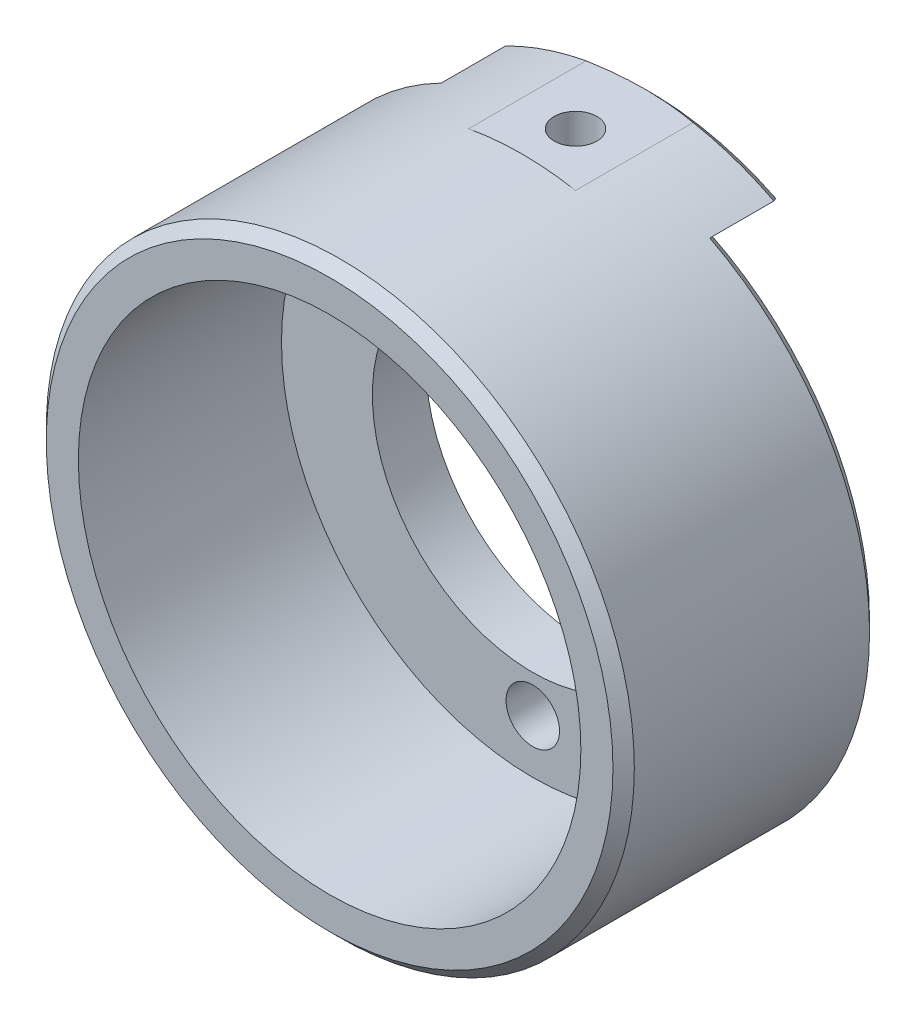
ISO-10303-21;
HEADER;
FILE_DESCRIPTION(('STEP AP214'),'2;1');
FILE_NAME('part.step','',(''),(''),'','','');
FILE_SCHEMA(('AUTOMOTIVE_DESIGN { 1 0 10303 214 1 1 1 1 }'));
ENDSEC;
DATA;
#1=APPLICATION_CONTEXT('core data for automotive mechanical design processes');
#2=APPLICATION_PROTOCOL_DEFINITION('international standard','automotive_design',2000,#1);
#3=PRODUCT_CONTEXT('',#1,'mechanical');
#4=PRODUCT('Part','Part','',(#3));
#5=PRODUCT_RELATED_PRODUCT_CATEGORY('part','',(#4));
#6=PRODUCT_DEFINITION_FORMATION('','',#4);
#7=PRODUCT_DEFINITION_CONTEXT('part definition',#1,'design');
#8=PRODUCT_DEFINITION('design','',#6,#7);
#9=PRODUCT_DEFINITION_SHAPE('','',#8);
#10=(LENGTH_UNIT() NAMED_UNIT(*) SI_UNIT(.MILLI.,.METRE.));
#11=(NAMED_UNIT(*) PLANE_ANGLE_UNIT() SI_UNIT($,.RADIAN.));
#12=(NAMED_UNIT(*) SI_UNIT($,.STERADIAN.) SOLID_ANGLE_UNIT());
#13=UNCERTAINTY_MEASURE_WITH_UNIT(LENGTH_MEASURE(1.E-05),#10,'distance_accuracy_value','');
#14=(GEOMETRIC_REPRESENTATION_CONTEXT(3) GLOBAL_UNCERTAINTY_ASSIGNED_CONTEXT((#13)) GLOBAL_UNIT_ASSIGNED_CONTEXT((#10,
#11,#12)) REPRESENTATION_CONTEXT('',''));
#15=CARTESIAN_POINT('',(0.,0.,0.));
#16=DIRECTION('',(0.,0.,1.));
#17=DIRECTION('',(1.,0.,0.));
#18=AXIS2_PLACEMENT_3D('',#15,#16,#17);
#19=CARTESIAN_POINT('',(-15.,0.,-19.));
#20=DIRECTION('',(0.,0.,1.));
#21=DIRECTION('',(1.,0.,0.));
#22=AXIS2_PLACEMENT_3D('',#19,#20,#21);
#23=PLANE('',#22);
#24=CARTESIAN_POINT('',(0.,18.5,-19.));
#25=DIRECTION('',(0.,0.,1.));
#26=DIRECTION('',(1.,0.,0.));
#27=AXIS2_PLACEMENT_3D('',#24,#25,#26);
#28=CIRCLE('',#27,2.5);
#29=CARTESIAN_POINT('',(2.5,18.5,-19.));
#30=VERTEX_POINT('',#29);
#31=EDGE_CURVE('E895',#30,#30,#28,.F.);
#32=ORIENTED_EDGE('',*,*,#31,.T.);
#33=EDGE_LOOP('',(#32));
#34=FACE_BOUND('',#33,.T.);
#35=CARTESIAN_POINT('',(0.,0.,-19.));
#36=DIRECTION('',(0.,0.,1.));
#37=DIRECTION('',(1.,0.,0.));
#38=AXIS2_PLACEMENT_3D('',#35,#36,#37);
#39=CIRCLE('',#38,23.5);
#40=CARTESIAN_POINT('',(23.5,0.,-19.));
#41=VERTEX_POINT('',#40);
#42=EDGE_CURVE('E306',#41,#41,#39,.T.);
#43=ORIENTED_EDGE('',*,*,#42,.T.);
#44=EDGE_LOOP('',(#43));
#45=FACE_BOUND('',#44,.T.);
#46=CARTESIAN_POINT('',(0.,0.,-19.));
#47=DIRECTION('',(0.,0.,1.));
#48=DIRECTION('',(1.,0.,0.));
#49=AXIS2_PLACEMENT_3D('',#46,#47,#48);
#50=CIRCLE('',#49,15.);
#51=CARTESIAN_POINT('',(15.,0.,-19.));
#52=VERTEX_POINT('',#51);
#53=EDGE_CURVE('E315',#52,#52,#50,.T.);
#54=ORIENTED_EDGE('',*,*,#53,.F.);
#55=EDGE_LOOP('',(#54));
#56=FACE_BOUND('',#55,.T.);
#57=CARTESIAN_POINT('',(0.,-18.5,-19.));
#58=DIRECTION('',(0.,0.,1.));
#59=DIRECTION('',(1.,0.,0.));
#60=AXIS2_PLACEMENT_3D('',#57,#58,#59);
#61=CIRCLE('',#60,2.5);
#62=CARTESIAN_POINT('',(2.5,-18.5,-19.));
#63=VERTEX_POINT('',#62);
#64=EDGE_CURVE('E61',#63,#63,#61,.T.);
#65=ORIENTED_EDGE('',*,*,#64,.F.);
#66=EDGE_LOOP('',(#65));
#67=FACE_BOUND('',#66,.T.);
#68=ADVANCED_FACE('F55',(#34,#45,#56,#67),#23,.T.);
#69=CARTESIAN_POINT('',(0.,0.,8.69565217391304));
#70=DIRECTION('',(0.,0.,1.));
#71=DIRECTION('',(1.,0.,0.));
#72=AXIS2_PLACEMENT_3D('',#69,#70,#71);
#73=CYLINDRICAL_SURFACE('',#72,27.5);
#74=CARTESIAN_POINT('',(0.,0.,-1.00000000000003));
#75=DIRECTION('',(0.,0.,1.));
#76=DIRECTION('',(1.,0.,0.));
#77=AXIS2_PLACEMENT_3D('',#74,#75,#76);
#78=CIRCLE('',#77,27.5);
#79=CARTESIAN_POINT('',(27.5,0.,-1.00000000000003));
#80=VERTEX_POINT('',#79);
#81=EDGE_CURVE('E342',#80,#80,#78,.F.);
#82=ORIENTED_EDGE('',*,*,#81,.T.);
#83=EDGE_LOOP('',(#82));
#84=FACE_BOUND('',#83,.T.);
#85=DIRECTION('',(0.,0.,1.));
#86=VECTOR('',#85,1.);
#87=CARTESIAN_POINT('',(-5.00000000000002,-27.0416345659799,-30.));
#88=LINE('',#87,#86);
#89=CARTESIAN_POINT('',(-5.00000000000002,-27.0416345659799,-29.));
#90=VERTEX_POINT('',#89);
#91=CARTESIAN_POINT('',(-5.,-27.0416345659799,-18.));
#92=VERTEX_POINT('',#91);
#93=EDGE_CURVE('E75',#90,#92,#88,.T.);
#94=ORIENTED_EDGE('',*,*,#93,.T.);
#95=CARTESIAN_POINT('',(0.,0.,-18.));
#96=DIRECTION('',(0.,0.,-1.));
#97=DIRECTION('',(-1.,0.,0.));
#98=AXIS2_PLACEMENT_3D('',#95,#96,#97);
#99=CIRCLE('',#98,27.5);
#100=CARTESIAN_POINT('',(5.,-27.0416345659799,-18.));
#101=VERTEX_POINT('',#100);
#102=EDGE_CURVE('E13',#101,#92,#99,.T.);
#103=ORIENTED_EDGE('',*,*,#102,.F.);
#104=DIRECTION('',(0.,0.,-1.));
#105=VECTOR('',#104,1.);
#106=CARTESIAN_POINT('',(4.99999999999999,-27.0416345659799,-30.));
#107=LINE('',#106,#105);
#108=CARTESIAN_POINT('',(4.99999999999999,-27.0416345659799,-29.));
#109=VERTEX_POINT('',#108);
#110=EDGE_CURVE('E184',#101,#109,#107,.T.);
#111=ORIENTED_EDGE('',*,*,#110,.T.);
#112=CARTESIAN_POINT('',(0.,0.,-29.));
#113=DIRECTION('',(0.,0.,-1.));
#114=DIRECTION('',(-1.,0.,0.));
#115=AXIS2_PLACEMENT_3D('',#112,#113,#114);
#116=CIRCLE('',#115,27.5);
#117=CARTESIAN_POINT('',(12.5555783533499,-24.4664556528503,-29.));
#118=VERTEX_POINT('',#117);
#119=EDGE_CURVE('E335',#109,#118,#116,.F.);
#120=ORIENTED_EDGE('',*,*,#119,.T.);
#121=DIRECTION('',(0.,0.,1.));
#122=VECTOR('',#121,1.);
#123=CARTESIAN_POINT('',(12.5555783533499,-24.4664556528503,-30.));
#124=LINE('',#123,#122);
#125=CARTESIAN_POINT('',(12.5555783533499,-24.4664556528503,-23.));
#126=VERTEX_POINT('',#125);
#127=EDGE_CURVE('E256',#118,#126,#124,.T.);
#128=ORIENTED_EDGE('',*,*,#127,.T.);
#129=CARTESIAN_POINT('',(0.,0.,-23.));
#130=DIRECTION('',(0.,0.,1.));
#131=DIRECTION('',(1.,0.,0.));
#132=AXIS2_PLACEMENT_3D('',#129,#130,#131);
#133=CIRCLE('',#132,27.5);
#134=CARTESIAN_POINT('',(12.5555783533499,24.4664556528503,-23.));
#135=VERTEX_POINT('',#134);
#136=EDGE_CURVE('E331',#126,#135,#133,.T.);
#137=ORIENTED_EDGE('',*,*,#136,.T.);
#138=DIRECTION('',(0.,0.,1.));
#139=VECTOR('',#138,1.);
#140=CARTESIAN_POINT('',(12.5555783533499,24.4664556528503,-30.));
#141=LINE('',#140,#139);
#142=CARTESIAN_POINT('',(12.5555783533499,24.4664556528503,-29.));
#143=VERTEX_POINT('',#142);
#144=EDGE_CURVE('E281',#143,#135,#141,.T.);
#145=ORIENTED_EDGE('',*,*,#144,.F.);
#146=CARTESIAN_POINT('',(0.,0.,-29.));
#147=DIRECTION('',(0.,0.,-1.));
#148=DIRECTION('',(-1.,0.,0.));
#149=AXIS2_PLACEMENT_3D('',#146,#147,#148);
#150=CIRCLE('',#149,27.5);
#151=CARTESIAN_POINT('',(4.99999999999998,27.0416345659799,-29.));
#152=VERTEX_POINT('',#151);
#153=EDGE_CURVE('E327',#143,#152,#150,.F.);
#154=ORIENTED_EDGE('',*,*,#153,.T.);
#155=DIRECTION('',(0.,0.,-1.));
#156=VECTOR('',#155,1.);
#157=CARTESIAN_POINT('',(4.99999999999999,27.0416345659799,-30.));
#158=LINE('',#157,#156);
#159=CARTESIAN_POINT('',(5.,27.0416345659799,-18.));
#160=VERTEX_POINT('',#159);
#161=EDGE_CURVE('E83',#160,#152,#158,.T.);
#162=ORIENTED_EDGE('',*,*,#161,.F.);
#163=CARTESIAN_POINT('',(0.,0.,-18.));
#164=DIRECTION('',(0.,0.,1.));
#165=DIRECTION('',(1.,0.,0.));
#166=AXIS2_PLACEMENT_3D('',#163,#164,#165);
#167=CIRCLE('',#166,27.5);
#168=CARTESIAN_POINT('',(-5.,27.0416345659799,-18.));
#169=VERTEX_POINT('',#168);
#170=EDGE_CURVE('E397',#160,#169,#167,.T.);
#171=ORIENTED_EDGE('',*,*,#170,.T.);
#172=DIRECTION('',(0.,0.,1.));
#173=VECTOR('',#172,1.);
#174=CARTESIAN_POINT('',(-5.00000000000002,27.0416345659799,-30.));
#175=LINE('',#174,#173);
#176=CARTESIAN_POINT('',(-5.00000000000002,27.0416345659799,-29.));
#177=VERTEX_POINT('',#176);
#178=EDGE_CURVE('E214',#177,#169,#175,.T.);
#179=ORIENTED_EDGE('',*,*,#178,.F.);
#180=CARTESIAN_POINT('',(-12.5555783533499,24.4664556528503,-29.));
#181=VERTEX_POINT('',#180);
#182=EDGE_CURVE('E326',#177,#181,#150,.F.);
#183=ORIENTED_EDGE('',*,*,#182,.T.);
#184=DIRECTION('',(0.,0.,1.));
#185=VECTOR('',#184,1.);
#186=CARTESIAN_POINT('',(-12.5555783533499,24.4664556528503,-30.));
#187=LINE('',#186,#185);
#188=CARTESIAN_POINT('',(-12.5555783533499,24.4664556528503,-23.));
#189=VERTEX_POINT('',#188);
#190=EDGE_CURVE('E295',#181,#189,#187,.T.);
#191=ORIENTED_EDGE('',*,*,#190,.T.);
#192=CARTESIAN_POINT('',(0.,0.,-23.));
#193=DIRECTION('',(0.,0.,1.));
#194=DIRECTION('',(1.,0.,0.));
#195=AXIS2_PLACEMENT_3D('',#192,#193,#194);
#196=CIRCLE('',#195,27.5);
#197=CARTESIAN_POINT('',(-12.5555783533499,-24.4664556528503,-23.));
#198=VERTEX_POINT('',#197);
#199=EDGE_CURVE('E338',#189,#198,#196,.T.);
#200=ORIENTED_EDGE('',*,*,#199,.T.);
#201=DIRECTION('',(0.,0.,1.));
#202=VECTOR('',#201,1.);
#203=CARTESIAN_POINT('',(-12.5555783533499,-24.4664556528503,-30.));
#204=LINE('',#203,#202);
#205=CARTESIAN_POINT('',(-12.5555783533499,-24.4664556528503,-29.));
#206=VERTEX_POINT('',#205);
#207=EDGE_CURVE('E253',#206,#198,#204,.T.);
#208=ORIENTED_EDGE('',*,*,#207,.F.);
#209=EDGE_CURVE('E197',#206,#90,#116,.F.);
#210=ORIENTED_EDGE('',*,*,#209,.T.);
#211=EDGE_LOOP('',(#94,#103,#111,#120,#128,#137,#145,#154,#162,#171,#179,#183,#191,#200,#208,#210));
#212=FACE_BOUND('',#211,.T.);
#213=ADVANCED_FACE('F193',(#84,#212),#73,.T.);
#214=CARTESIAN_POINT('',(0.,0.,-30.));
#215=DIRECTION('',(0.,0.,1.));
#216=DIRECTION('',(1.,0.,0.));
#217=AXIS2_PLACEMENT_3D('',#214,#215,#216);
#218=CONICAL_SURFACE('',#217,26.5,0.785398163397443);
#219=ORIENTED_EDGE('',*,*,#119,.F.);
#220=CARTESIAN_POINT('',(15.0500756211209,-27.0416345659799,-25.5523865831069));
#221=CARTESIAN_POINT('',(14.5296760616178,-27.0416345659799,-25.8054233573197));
#222=CARTESIAN_POINT('',(14.0052826862607,-27.0416345659799,-26.050454865097));
#223=CARTESIAN_POINT('',(12.9479675077693,-27.0416345659799,-26.5220870108823));
#224=CARTESIAN_POINT('',(12.4150414991349,-27.0416345659799,-26.7486782031817));
#225=CARTESIAN_POINT('',(11.3378842009209,-27.0416345659799,-27.181858662804));
#226=CARTESIAN_POINT('',(10.7936088371063,-27.0416345659799,-27.388338962018));
#227=CARTESIAN_POINT('',(9.69650665552811,-27.0416345659799,-27.7770275309525));
#228=CARTESIAN_POINT('',(9.14368108399417,-27.0416345659799,-27.9592393013898));
#229=CARTESIAN_POINT('',(8.03777202398614,-27.0416345659799,-28.2939346200528));
#230=CARTESIAN_POINT('',(7.48480764469433,-27.0416345659799,-28.4468096208547));
#231=CARTESIAN_POINT('',(6.37149616932471,-27.0416345659799,-28.7231164458829));
#232=CARTESIAN_POINT('',(5.81114874306676,-27.0416345659799,-28.8465469485618));
#233=CARTESIAN_POINT('',(4.6854764999112,-27.0416345659799,-29.0609931325601));
#234=CARTESIAN_POINT('',(4.12016470877339,-27.0416345659799,-29.1520767844472));
#235=CARTESIAN_POINT('',(2.98508701221859,-27.0416345659799,-29.299920484318));
#236=CARTESIAN_POINT('',(2.41532168552037,-27.0416345659799,-29.3566849192341));
#237=CARTESIAN_POINT('',(1.42167144377623,-27.0416345659799,-29.4243076266971));
#238=CARTESIAN_POINT('',(0.998322077079228,-27.0416345659799,-29.4432585799995));
#239=CARTESIAN_POINT('',(0.151204682347689,-27.0416345659799,-29.4612572113786));
#240=CARTESIAN_POINT('',(-0.272563327959556,-27.0416345659799,-29.4603056988941));
#241=CARTESIAN_POINT('',(-1.11972793216916,-27.0416345659799,-29.4385069304169));
#242=CARTESIAN_POINT('',(-1.5431243489504,-27.0416345659799,-29.4176528542206));
#243=CARTESIAN_POINT('',(-2.38849650677339,-27.0416345659799,-29.3563603631251));
#244=CARTESIAN_POINT('',(-2.81047222634094,-27.0416345659799,-29.3159216535252));
#245=CARTESIAN_POINT('',(-3.6525359710246,-27.0416345659799,-29.2160099498527));
#246=CARTESIAN_POINT('',(-4.07262201845404,-27.0416345659799,-29.1565203109573));
#247=CARTESIAN_POINT('',(-4.90982819176813,-27.0416345659799,-29.0193571539299));
#248=CARTESIAN_POINT('',(-5.32694796940217,-27.0416345659799,-28.9416815358633));
#249=CARTESIAN_POINT('',(-6.57274513713416,-27.0416345659799,-28.6828852841189));
#250=CARTESIAN_POINT('',(-7.39618099965203,-27.0416345659799,-28.4759558931792));
#251=CARTESIAN_POINT('',(-8.80058374562092,-27.0416345659799,-28.0679590549651));
#252=CARTESIAN_POINT('',(-9.38577901938159,-27.0416345659799,-27.8810198956777));
#253=CARTESIAN_POINT('',(-10.5466057034064,-27.0416345659799,-27.4795841958254));
#254=CARTESIAN_POINT('',(-11.1222376962483,-27.0416345659799,-27.265089340907));
#255=CARTESIAN_POINT('',(-12.2620266618528,-27.0416345659799,-26.8127262217107));
#256=CARTESIAN_POINT('',(-12.8262145470319,-27.0416345659799,-26.5749352248));
#257=CARTESIAN_POINT('',(-13.9451133572114,-27.0416345659799,-26.0785321734578));
#258=CARTESIAN_POINT('',(-14.4998278675305,-27.0416345659799,-25.8199282175779));
#259=CARTESIAN_POINT('',(-15.0500756211209,-27.0416345659799,-25.5523865831069));
#260=B_SPLINE_CURVE_WITH_KNOTS('',3,(#220,#221,#222,#223,#224,#225,#226,#227,#228,#229,#230,
#231,#232,#233,#234,#235,#236,#237,#238,#239,#240,#241,#242,#243,#244,#245,#246,#247,#248,#249,
#250,#251,#252,#253,#254,#255,#256,#257,#258,#259),.UNSPECIFIED.,.F.,.F.,(4,2,2,2,2,2,2,2,2,2,2,
2,2,2,2,2,2,2,2,4),(0.,1.73603612227931,3.47295597177922,5.21881694814365,6.96442581199732,
8.68481590547916,10.4052832001205,12.1221135754757,13.8387244466408,15.109607135557,
16.380438137421,17.6517047836363,18.9229905598819,20.1953901045632,21.4679366457185,
24.0120636773891,25.85440780955,27.6966392948192,29.5329550922438,31.3685597818596),.UNSPECIFIED.);
#261=EDGE_CURVE('E67',#109,#90,#260,.T.);
#262=ORIENTED_EDGE('',*,*,#261,.T.);
#263=ORIENTED_EDGE('',*,*,#209,.F.);
#264=CARTESIAN_POINT('',(-11.7215959154198,-23.7666612967748,-30.));
#265=CARTESIAN_POINT('',(-11.8608111857142,-23.8834767787332,-29.8336434259739));
#266=CARTESIAN_POINT('',(-11.9999173582939,-24.0002007168393,-29.6671318044986));
#267=CARTESIAN_POINT('',(-12.2779115042647,-24.2334655021928,-29.3337984711569));
#268=CARTESIAN_POINT('',(-12.4167994776617,-24.3500063494452,-29.1669767592989));
#269=CARTESIAN_POINT('',(-12.5555783533499,-24.4664556528503,-29.));
#270=B_SPLINE_CURVE_WITH_KNOTS('',3,(#264,#265,#266,#267,#268,#269),.UNSPECIFIED.,.F.,.F.,(4,2,
4),(0.,0.739127949388996,1.4782558787888),.UNSPECIFIED.);
#271=CARTESIAN_POINT('',(-11.7215959154198,-23.7666612967748,-30.));
#272=VERTEX_POINT('',#271);
#273=EDGE_CURVE('E353',#272,#206,#270,.T.);
#274=ORIENTED_EDGE('',*,*,#273,.F.);
#275=CARTESIAN_POINT('',(0.,0.,-30.));
#276=DIRECTION('',(0.,0.,-1.));
#277=DIRECTION('',(-1.,0.,0.));
#278=AXIS2_PLACEMENT_3D('',#275,#276,#277);
#279=CIRCLE('',#278,26.5);
#280=CARTESIAN_POINT('',(11.7215959154198,-23.7666612967748,-30.));
#281=VERTEX_POINT('',#280);
#282=EDGE_CURVE('E349',#281,#272,#279,.T.);
#283=ORIENTED_EDGE('',*,*,#282,.F.);
#284=CARTESIAN_POINT('',(12.5555783533499,-24.4664556528503,-29.));
#285=CARTESIAN_POINT('',(12.4167994776617,-24.3500063494452,-29.1669767592989));
#286=CARTESIAN_POINT('',(12.2779115042647,-24.2334655021928,-29.3337984711569));
#287=CARTESIAN_POINT('',(11.9999173582939,-24.0002007168393,-29.6671318044986));
#288=CARTESIAN_POINT('',(11.8608111857142,-23.8834767787332,-29.8336434259739));
#289=CARTESIAN_POINT('',(11.7215959154198,-23.7666612967748,-30.));
#290=B_SPLINE_CURVE_WITH_KNOTS('',3,(#284,#285,#286,#287,#288,#289),.UNSPECIFIED.,.F.,.F.,(4,2,
4),(0.,0.739127929399806,1.4782558787888),.UNSPECIFIED.);
#291=EDGE_CURVE('E362',#118,#281,#290,.T.);
#292=ORIENTED_EDGE('',*,*,#291,.F.);
#293=EDGE_LOOP('',(#219,#262,#263,#274,#283,#292));
#294=FACE_BOUND('',#293,.T.);
#295=ADVANCED_FACE('F373',(#294),#218,.T.);
#296=CARTESIAN_POINT('',(0.,0.,-30.));
#297=DIRECTION('',(0.,0.,1.));
#298=DIRECTION('',(1.,0.,0.));
#299=AXIS2_PLACEMENT_3D('',#296,#297,#298);
#300=CONICAL_SURFACE('',#299,26.5,0.785398163397443);
#301=ORIENTED_EDGE('',*,*,#182,.F.);
#302=CARTESIAN_POINT('',(-15.0500756211209,27.0416345659799,-25.5523865831069));
#303=CARTESIAN_POINT('',(-14.5296760616179,27.0416345659799,-25.8054233573197));
#304=CARTESIAN_POINT('',(-14.0052826862608,27.0416345659799,-26.050454865097));
#305=CARTESIAN_POINT('',(-12.9479675077693,27.0416345659799,-26.5220870108823));
#306=CARTESIAN_POINT('',(-12.4150414991349,27.0416345659799,-26.7486782031817));
#307=CARTESIAN_POINT('',(-11.3378842009209,27.0416345659799,-27.181858662804));
#308=CARTESIAN_POINT('',(-10.7936088371063,27.0416345659799,-27.388338962018));
#309=CARTESIAN_POINT('',(-9.69650665552812,27.0416345659799,-27.7770275309525));
#310=CARTESIAN_POINT('',(-9.14368108399418,27.0416345659799,-27.9592393013898));
#311=CARTESIAN_POINT('',(-8.03777202398615,27.0416345659799,-28.2939346200528));
#312=CARTESIAN_POINT('',(-7.48480764469434,27.0416345659799,-28.4468096208547));
#313=CARTESIAN_POINT('',(-6.37149616932472,27.0416345659799,-28.7231164458829));
#314=CARTESIAN_POINT('',(-5.81114874306676,27.0416345659799,-28.8465469485618));
#315=CARTESIAN_POINT('',(-4.68547649991121,27.0416345659799,-29.0609931325601));
#316=CARTESIAN_POINT('',(-4.12016470877339,27.0416345659799,-29.1520767844472));
#317=CARTESIAN_POINT('',(-2.98508701221859,27.0416345659799,-29.299920484318));
#318=CARTESIAN_POINT('',(-2.41532168552037,27.0416345659799,-29.3566849192341));
#319=CARTESIAN_POINT('',(-1.42167144377623,27.0416345659799,-29.4243076266971));
#320=CARTESIAN_POINT('',(-0.998322077079225,27.0416345659799,-29.4432585799995));
#321=CARTESIAN_POINT('',(-0.151204682347686,27.0416345659799,-29.4612572113786));
#322=CARTESIAN_POINT('',(0.272563327959559,27.0416345659799,-29.4603056988941));
#323=CARTESIAN_POINT('',(1.11972793216916,27.0416345659799,-29.4385069304169));
#324=CARTESIAN_POINT('',(1.5431243489504,27.0416345659799,-29.4176528542206));
#325=CARTESIAN_POINT('',(2.3884965067734,27.0416345659799,-29.3563603631251));
#326=CARTESIAN_POINT('',(2.81047222634094,27.0416345659799,-29.3159216535252));
#327=CARTESIAN_POINT('',(3.6525359710246,27.0416345659799,-29.2160099498527));
#328=CARTESIAN_POINT('',(4.07262201845404,27.0416345659799,-29.1565203109573));
#329=CARTESIAN_POINT('',(4.90982819176814,27.0416345659799,-29.0193571539299));
#330=CARTESIAN_POINT('',(5.32694796940217,27.0416345659799,-28.9416815358633));
#331=CARTESIAN_POINT('',(6.57274513713416,27.0416345659799,-28.6828852841189));
#332=CARTESIAN_POINT('',(7.39618099965203,27.0416345659799,-28.4759558931792));
#333=CARTESIAN_POINT('',(8.80058374562092,27.0416345659799,-28.0679590549651));
#334=CARTESIAN_POINT('',(9.38577901938159,27.0416345659799,-27.8810198956777));
#335=CARTESIAN_POINT('',(10.5466057034064,27.0416345659799,-27.4795841958254));
#336=CARTESIAN_POINT('',(11.1222376962483,27.0416345659799,-27.265089340907));
#337=CARTESIAN_POINT('',(12.2620266618528,27.0416345659799,-26.8127262217107));
#338=CARTESIAN_POINT('',(12.8262145470319,27.0416345659799,-26.5749352248));
#339=CARTESIAN_POINT('',(13.9451133572114,27.0416345659799,-26.0785321734579));
#340=CARTESIAN_POINT('',(14.4998278675305,27.0416345659799,-25.8199282175779));
#341=CARTESIAN_POINT('',(15.0500756211209,27.0416345659799,-25.5523865831069));
#342=B_SPLINE_CURVE_WITH_KNOTS('',3,(#302,#303,#304,#305,#306,#307,#308,#309,#310,#311,#312,
#313,#314,#315,#316,#317,#318,#319,#320,#321,#322,#323,#324,#325,#326,#327,#328,#329,#330,#331,
#332,#333,#334,#335,#336,#337,#338,#339,#340,#341),.UNSPECIFIED.,.F.,.F.,(4,2,2,2,2,2,2,2,2,2,2,
2,2,2,2,2,2,2,2,4),(0.,1.73603612227932,3.47295597177923,5.21881694814366,6.96442581199734,
8.68481590547918,10.4052832001206,12.1221135754757,13.8387244466408,15.1096071355571,
16.3804381374211,17.6517047836363,18.9229905598819,20.1953901045632,21.4679366457185,
24.0120636773891,25.85440780955,27.6966392948192,29.5329550922438,31.3685597818596),.UNSPECIFIED.);
#343=EDGE_CURVE('E421',#177,#152,#342,.T.);
#344=ORIENTED_EDGE('',*,*,#343,.T.);
#345=ORIENTED_EDGE('',*,*,#153,.F.);
#346=CARTESIAN_POINT('',(11.7215959154198,23.7666612967748,-30.));
#347=CARTESIAN_POINT('',(11.8608111857142,23.8834767787332,-29.8336434259739));
#348=CARTESIAN_POINT('',(11.9999173582939,24.0002007168393,-29.6671318044986));
#349=CARTESIAN_POINT('',(12.2779115042647,24.2334655021928,-29.3337984711569));
#350=CARTESIAN_POINT('',(12.4167994776617,24.3500063494452,-29.1669767592989));
#351=CARTESIAN_POINT('',(12.5555783533499,24.4664556528503,-29.));
#352=B_SPLINE_CURVE_WITH_KNOTS('',3,(#346,#347,#348,#349,#350,#351),.UNSPECIFIED.,.F.,.F.,(4,2,
4),(0.,0.739127949388992,1.4782558787888),.UNSPECIFIED.);
#353=CARTESIAN_POINT('',(11.7215959154198,23.7666612967748,-30.));
#354=VERTEX_POINT('',#353);
#355=EDGE_CURVE('E497',#354,#143,#352,.T.);
#356=ORIENTED_EDGE('',*,*,#355,.F.);
#357=CARTESIAN_POINT('',(0.,0.,-30.));
#358=DIRECTION('',(0.,0.,-1.));
#359=DIRECTION('',(-1.,0.,0.));
#360=AXIS2_PLACEMENT_3D('',#357,#358,#359);
#361=CIRCLE('',#360,26.5);
#362=CARTESIAN_POINT('',(-11.7215959154198,23.7666612967748,-30.));
#363=VERTEX_POINT('',#362);
#364=EDGE_CURVE('E502',#363,#354,#361,.T.);
#365=ORIENTED_EDGE('',*,*,#364,.F.);
#366=CARTESIAN_POINT('',(-12.5555783533499,24.4664556528503,-29.));
#367=CARTESIAN_POINT('',(-12.4167994776617,24.3500063494452,-29.1669767592989));
#368=CARTESIAN_POINT('',(-12.2779115042647,24.2334655021928,-29.3337984711569));
#369=CARTESIAN_POINT('',(-11.9999173582939,24.0002007168393,-29.6671318044986));
#370=CARTESIAN_POINT('',(-11.8608111857142,23.8834767787332,-29.8336434259739));
#371=CARTESIAN_POINT('',(-11.7215959154198,23.7666612967748,-30.));
#372=B_SPLINE_CURVE_WITH_KNOTS('',3,(#366,#367,#368,#369,#370,#371),.UNSPECIFIED.,.F.,.F.,(4,2,
4),(0.,0.739127929399806,1.4782558787888),.UNSPECIFIED.);
#373=EDGE_CURVE('E473',#181,#363,#372,.T.);
#374=ORIENTED_EDGE('',*,*,#373,.F.);
#375=EDGE_LOOP('',(#301,#344,#345,#356,#365,#374));
#376=FACE_BOUND('',#375,.T.);
#377=ADVANCED_FACE('F58',(#376),#300,.T.);
#378=CARTESIAN_POINT('',(-15.,0.,-24.));
#379=DIRECTION('',(0.,0.,1.));
#380=DIRECTION('',(1.,0.,0.));
#381=AXIS2_PLACEMENT_3D('',#378,#379,#380);
#382=PLANE('',#381);
#383=DIRECTION('',(0.766044443118979,0.642787609686538,0.));
#384=VECTOR('',#383,1.);
#385=CARTESIAN_POINT('',(-6.85971508146004,8.17509009250272,-24.));
#386=LINE('',#385,#384);
#387=CARTESIAN_POINT('',(2.24975663390288,15.8188444490836,-24.));
#388=VERTEX_POINT('',#387);
#389=CARTESIAN_POINT('',(11.7215959154198,23.7666612967748,-24.));
#390=VERTEX_POINT('',#389);
#391=EDGE_CURVE('E263',#388,#390,#386,.T.);
#392=ORIENTED_EDGE('',*,*,#391,.T.);
#393=CARTESIAN_POINT('',(0.,0.,-24.));
#394=DIRECTION('',(0.,0.,1.));
#395=DIRECTION('',(1.,0.,0.));
#396=AXIS2_PLACEMENT_3D('',#393,#394,#395);
#397=CIRCLE('',#396,26.5);
#398=CARTESIAN_POINT('',(11.7215959154198,-23.7666612967748,-24.));
#399=VERTEX_POINT('',#398);
#400=EDGE_CURVE('E507',#390,#399,#397,.F.);
#401=ORIENTED_EDGE('',*,*,#400,.T.);
#402=DIRECTION('',(0.766044443118979,-0.642787609686538,0.));
#403=VECTOR('',#402,1.);
#404=CARTESIAN_POINT('',(-6.85971508146004,-8.17509009250272,-24.));
#405=LINE('',#404,#403);
#406=CARTESIAN_POINT('',(2.24975663390288,-15.8188444490836,-24.));
#407=VERTEX_POINT('',#406);
#408=EDGE_CURVE('E244',#407,#399,#405,.T.);
#409=ORIENTED_EDGE('',*,*,#408,.F.);
#410=CARTESIAN_POINT('',(0.,-18.5,-24.));
#411=DIRECTION('',(0.,0.,-1.));
#412=DIRECTION('',(-1.,0.,0.));
#413=AXIS2_PLACEMENT_3D('',#410,#411,#412);
#414=CIRCLE('',#413,3.5);
#415=CARTESIAN_POINT('',(0.,-15.,-24.));
#416=VERTEX_POINT('',#415);
#417=EDGE_CURVE('E222',#416,#407,#414,.T.);
#418=ORIENTED_EDGE('',*,*,#417,.F.);
#419=CARTESIAN_POINT('',(0.,0.,-24.));
#420=DIRECTION('',(0.,0.,1.));
#421=DIRECTION('',(1.,0.,0.));
#422=AXIS2_PLACEMENT_3D('',#419,#420,#421);
#423=CIRCLE('',#422,15.);
#424=CARTESIAN_POINT('',(0.,15.,-24.));
#425=VERTEX_POINT('',#424);
#426=EDGE_CURVE('E310',#416,#425,#423,.T.);
#427=ORIENTED_EDGE('',*,*,#426,.T.);
#428=CARTESIAN_POINT('',(0.,18.5,-24.));
#429=DIRECTION('',(0.,0.,-1.));
#430=DIRECTION('',(-1.,0.,0.));
#431=AXIS2_PLACEMENT_3D('',#428,#429,#430);
#432=CIRCLE('',#431,3.5);
#433=EDGE_CURVE('E289',#425,#388,#432,.F.);
#434=ORIENTED_EDGE('',*,*,#433,.T.);
#435=EDGE_LOOP('',(#392,#401,#409,#418,#427,#434));
#436=FACE_BOUND('',#435,.T.);
#437=ADVANCED_FACE('F519',(#436),#382,.F.);
#438=DIRECTION('',(-0.766044443118979,-0.642787609686538,0.));
#439=VECTOR('',#438,1.);
#440=CARTESIAN_POINT('',(6.85971508146004,-8.17509009250272,-24.));
#441=LINE('',#440,#439);
#442=CARTESIAN_POINT('',(-2.24975663390288,-15.8188444490836,-24.));
#443=VERTEX_POINT('',#442);
#444=CARTESIAN_POINT('',(-11.7215959154198,-23.7666612967748,-24.));
#445=VERTEX_POINT('',#444);
#446=EDGE_CURVE('E228',#443,#445,#441,.T.);
#447=ORIENTED_EDGE('',*,*,#446,.T.);
#448=CARTESIAN_POINT('',(0.,0.,-24.));
#449=DIRECTION('',(0.,0.,1.));
#450=DIRECTION('',(1.,0.,0.));
#451=AXIS2_PLACEMENT_3D('',#448,#449,#450);
#452=CIRCLE('',#451,26.5);
#453=CARTESIAN_POINT('',(-11.7215959154198,23.7666612967748,-24.));
#454=VERTEX_POINT('',#453);
#455=EDGE_CURVE('E346',#445,#454,#452,.F.);
#456=ORIENTED_EDGE('',*,*,#455,.T.);
#457=DIRECTION('',(-0.766044443118979,0.642787609686538,0.));
#458=VECTOR('',#457,1.);
#459=CARTESIAN_POINT('',(6.85971508146004,8.17509009250272,-24.));
#460=LINE('',#459,#458);
#461=CARTESIAN_POINT('',(-2.24975663390288,15.8188444490836,-24.));
#462=VERTEX_POINT('',#461);
#463=EDGE_CURVE('E269',#462,#454,#460,.T.);
#464=ORIENTED_EDGE('',*,*,#463,.F.);
#465=EDGE_CURVE('E285',#462,#425,#432,.F.);
#466=ORIENTED_EDGE('',*,*,#465,.T.);
#467=EDGE_CURVE('E311',#425,#416,#423,.T.);
#468=ORIENTED_EDGE('',*,*,#467,.T.);
#469=EDGE_CURVE('E241',#443,#416,#414,.T.);
#470=ORIENTED_EDGE('',*,*,#469,.F.);
#471=EDGE_LOOP('',(#447,#456,#464,#466,#468,#470));
#472=FACE_BOUND('',#471,.T.);
#473=ADVANCED_FACE('F523',(#472),#382,.F.);
#474=CARTESIAN_POINT('',(0.,0.,8.69565217391304));
#475=DIRECTION('',(0.,0.,1.));
#476=DIRECTION('',(1.,0.,0.));
#477=AXIS2_PLACEMENT_3D('',#474,#475,#476);
#478=CYLINDRICAL_SURFACE('',#477,15.);
#479=ORIENTED_EDGE('',*,*,#53,.T.);
#480=EDGE_LOOP('',(#479));
#481=FACE_BOUND('',#480,.T.);
#482=ORIENTED_EDGE('',*,*,#467,.F.);
#483=ORIENTED_EDGE('',*,*,#426,.F.);
#484=EDGE_LOOP('',(#482,#483));
#485=FACE_BOUND('',#484,.T.);
#486=ADVANCED_FACE('F518',(#481,#485),#478,.F.);
#487=CARTESIAN_POINT('',(-23.5,0.,0.));
#488=DIRECTION('',(0.,0.,1.));
#489=DIRECTION('',(1.,0.,0.));
#490=AXIS2_PLACEMENT_3D('',#487,#488,#489);
#491=PLANE('',#490);
#492=CARTESIAN_POINT('',(0.,0.,0.));
#493=DIRECTION('',(0.,0.,1.));
#494=DIRECTION('',(1.,0.,0.));
#495=AXIS2_PLACEMENT_3D('',#492,#493,#494);
#496=CIRCLE('',#495,26.5);
#497=CARTESIAN_POINT('',(26.5,0.,0.));
#498=VERTEX_POINT('',#497);
#499=EDGE_CURVE('E322',#498,#498,#496,.T.);
#500=ORIENTED_EDGE('',*,*,#499,.T.);
#501=EDGE_LOOP('',(#500));
#502=FACE_BOUND('',#501,.T.);
#503=CARTESIAN_POINT('',(0.,0.,0.));
#504=DIRECTION('',(0.,0.,1.));
#505=DIRECTION('',(1.,0.,0.));
#506=AXIS2_PLACEMENT_3D('',#503,#504,#505);
#507=CIRCLE('',#506,23.5);
#508=CARTESIAN_POINT('',(23.5,0.,0.));
#509=VERTEX_POINT('',#508);
#510=EDGE_CURVE('E305',#509,#509,#507,.T.);
#511=ORIENTED_EDGE('',*,*,#510,.F.);
#512=EDGE_LOOP('',(#511));
#513=FACE_BOUND('',#512,.T.);
#514=ADVANCED_FACE('F527',(#502,#513),#491,.T.);
#515=CARTESIAN_POINT('',(0.,0.,8.69565217391304));
#516=DIRECTION('',(0.,0.,1.));
#517=DIRECTION('',(1.,0.,0.));
#518=AXIS2_PLACEMENT_3D('',#515,#516,#517);
#519=CYLINDRICAL_SURFACE('',#518,23.5);
#520=ORIENTED_EDGE('',*,*,#42,.F.);
#521=EDGE_LOOP('',(#520));
#522=FACE_BOUND('',#521,.T.);
#523=ORIENTED_EDGE('',*,*,#510,.T.);
#524=EDGE_LOOP('',(#523));
#525=FACE_BOUND('',#524,.T.);
#526=ADVANCED_FACE('F517',(#522,#525),#519,.F.);
#527=CARTESIAN_POINT('',(-6.85971508146004,8.17509009250272,-30.));
#528=DIRECTION('',(0.642787609686538,-0.766044443118979,0.));
#529=DIRECTION('',(0.766044443118979,0.642787609686538,0.));
#530=AXIS2_PLACEMENT_3D('',#527,#528,#529);
#531=PLANE('',#530);
#532=DIRECTION('',(0.766044443118979,0.642787609686538,0.));
#533=VECTOR('',#532,1.);
#534=CARTESIAN_POINT('',(-6.85971508146004,8.17509009250272,-30.));
#535=LINE('',#534,#533);
#536=CARTESIAN_POINT('',(2.24975663390288,15.8188444490836,-30.));
#537=VERTEX_POINT('',#536);
#538=EDGE_CURVE('E264',#537,#354,#535,.T.);
#539=ORIENTED_EDGE('',*,*,#538,.T.);
#540=ORIENTED_EDGE('',*,*,#355,.T.);
#541=ORIENTED_EDGE('',*,*,#144,.T.);
#542=CARTESIAN_POINT('',(12.5555783533499,24.4664556528503,-23.));
#543=CARTESIAN_POINT('',(12.4167994776617,24.3500063494452,-23.1669767592989));
#544=CARTESIAN_POINT('',(12.2779115042647,24.2334655021928,-23.3337984711569));
#545=CARTESIAN_POINT('',(11.9999173582939,24.0002007168393,-23.6671318044986));
#546=CARTESIAN_POINT('',(11.8608111857142,23.8834767787332,-23.8336434259739));
#547=CARTESIAN_POINT('',(11.7215959154198,23.7666612967748,-24.));
#548=B_SPLINE_CURVE_WITH_KNOTS('',3,(#542,#543,#544,#545,#546,#547),.UNSPECIFIED.,.F.,.F.,(4,2,
4),(0.,0.739127929399808,1.47825587878881),.UNSPECIFIED.);
#549=EDGE_CURVE('E436',#135,#390,#548,.T.);
#550=ORIENTED_EDGE('',*,*,#549,.T.);
#551=ORIENTED_EDGE('',*,*,#391,.F.);
#552=DIRECTION('',(0.,0.,1.));
#553=VECTOR('',#552,1.);
#554=CARTESIAN_POINT('',(2.24975663390288,15.8188444490836,-30.));
#555=LINE('',#554,#553);
#556=EDGE_CURVE('E301',#537,#388,#555,.T.);
#557=ORIENTED_EDGE('',*,*,#556,.F.);
#558=EDGE_LOOP('',(#539,#540,#541,#550,#551,#557));
#559=FACE_BOUND('',#558,.T.);
#560=ADVANCED_FACE('F513',(#559),#531,.T.);
#561=CARTESIAN_POINT('',(0.,18.5,-30.));
#562=DIRECTION('',(0.,0.,1.));
#563=DIRECTION('',(1.,0.,0.));
#564=AXIS2_PLACEMENT_3D('',#561,#562,#563);
#565=CYLINDRICAL_SURFACE('',#564,3.5);
#566=ORIENTED_EDGE('',*,*,#465,.F.);
#567=DIRECTION('',(0.,0.,1.));
#568=VECTOR('',#567,1.);
#569=CARTESIAN_POINT('',(-2.24975663390288,15.8188444490836,-30.));
#570=LINE('',#569,#568);
#571=CARTESIAN_POINT('',(-2.24975663390288,15.8188444490836,-30.));
#572=VERTEX_POINT('',#571);
#573=EDGE_CURVE('E298',#572,#462,#570,.T.);
#574=ORIENTED_EDGE('',*,*,#573,.F.);
#575=CARTESIAN_POINT('',(0.,18.5,-30.));
#576=DIRECTION('',(0.,0.,-1.));
#577=DIRECTION('',(-1.,0.,0.));
#578=AXIS2_PLACEMENT_3D('',#575,#576,#577);
#579=CIRCLE('',#578,3.5);
#580=EDGE_CURVE('E268',#572,#537,#579,.F.);
#581=ORIENTED_EDGE('',*,*,#580,.T.);
#582=ORIENTED_EDGE('',*,*,#556,.T.);
#583=ORIENTED_EDGE('',*,*,#433,.F.);
#584=EDGE_LOOP('',(#566,#574,#581,#582,#583));
#585=FACE_BOUND('',#584,.T.);
#586=ADVANCED_FACE('F469',(#585),#565,.T.);
#587=CARTESIAN_POINT('',(6.85971508146004,8.17509009250272,-30.));
#588=DIRECTION('',(0.642787609686538,0.766044443118979,0.));
#589=DIRECTION('',(-0.766044443118979,0.642787609686538,0.));
#590=AXIS2_PLACEMENT_3D('',#587,#588,#589);
#591=PLANE('',#590);
#592=ORIENTED_EDGE('',*,*,#190,.F.);
#593=ORIENTED_EDGE('',*,*,#373,.T.);
#594=DIRECTION('',(-0.766044443118979,0.642787609686538,0.));
#595=VECTOR('',#594,1.);
#596=CARTESIAN_POINT('',(6.85971508146004,8.17509009250272,-30.));
#597=LINE('',#596,#595);
#598=EDGE_CURVE('E273',#572,#363,#597,.T.);
#599=ORIENTED_EDGE('',*,*,#598,.F.);
#600=ORIENTED_EDGE('',*,*,#573,.T.);
#601=ORIENTED_EDGE('',*,*,#463,.T.);
#602=CARTESIAN_POINT('',(-11.7215959154198,23.7666612967748,-24.));
#603=CARTESIAN_POINT('',(-11.8608111857142,23.8834767787332,-23.8336434259739));
#604=CARTESIAN_POINT('',(-11.9999173582939,24.0002007168393,-23.6671318044986));
#605=CARTESIAN_POINT('',(-12.2779115042647,24.2334655021928,-23.3337984711569));
#606=CARTESIAN_POINT('',(-12.4167994776617,24.3500063494452,-23.1669767592989));
#607=CARTESIAN_POINT('',(-12.5555783533499,24.4664556528503,-23.));
#608=B_SPLINE_CURVE_WITH_KNOTS('',3,(#602,#603,#604,#605,#606,#607),.UNSPECIFIED.,.F.,.F.,(4,2,
4),(0.,0.739127949389002,1.47825587878881),.UNSPECIFIED.);
#609=EDGE_CURVE('E480',#454,#189,#608,.T.);
#610=ORIENTED_EDGE('',*,*,#609,.T.);
#611=EDGE_LOOP('',(#592,#593,#599,#600,#601,#610));
#612=FACE_BOUND('',#611,.T.);
#613=ADVANCED_FACE('F464',(#612),#591,.F.);
#614=CARTESIAN_POINT('',(0.,18.5,-30.));
#615=DIRECTION('',(0.,0.,1.));
#616=DIRECTION('',(1.,0.,0.));
#617=AXIS2_PLACEMENT_3D('',#614,#615,#616);
#618=CYLINDRICAL_SURFACE('',#617,2.5);
#619=CARTESIAN_POINT('',(0.,18.5,-30.));
#620=DIRECTION('',(0.,0.,-1.));
#621=DIRECTION('',(-1.,0.,0.));
#622=AXIS2_PLACEMENT_3D('',#619,#620,#621);
#623=CIRCLE('',#622,2.5);
#624=CARTESIAN_POINT('',(-2.5,18.5,-30.));
#625=VERTEX_POINT('',#624);
#626=EDGE_CURVE('E277',#625,#625,#623,.F.);
#627=ORIENTED_EDGE('',*,*,#626,.F.);
#628=EDGE_LOOP('',(#627));
#629=FACE_BOUND('',#628,.T.);
#630=ORIENTED_EDGE('',*,*,#31,.F.);
#631=EDGE_LOOP('',(#630));
#632=FACE_BOUND('',#631,.T.);
#633=ADVANCED_FACE('F460',(#629,#632),#618,.F.);
#634=CARTESIAN_POINT('',(0.,0.,-30.));
#635=DIRECTION('',(0.,0.,-1.));
#636=DIRECTION('',(-1.,0.,0.));
#637=AXIS2_PLACEMENT_3D('',#634,#635,#636);
#638=PLANE('',#637);
#639=ORIENTED_EDGE('',*,*,#598,.T.);
#640=ORIENTED_EDGE('',*,*,#364,.T.);
#641=ORIENTED_EDGE('',*,*,#538,.F.);
#642=ORIENTED_EDGE('',*,*,#580,.F.);
#643=EDGE_LOOP('',(#639,#640,#641,#642));
#644=FACE_BOUND('',#643,.T.);
#645=ORIENTED_EDGE('',*,*,#626,.T.);
#646=EDGE_LOOP('',(#645));
#647=FACE_BOUND('',#646,.T.);
#648=ADVANCED_FACE('F453',(#644,#647),#638,.T.);
#649=CARTESIAN_POINT('',(0.,-18.5,-30.));
#650=DIRECTION('',(0.,0.,1.));
#651=DIRECTION('',(1.,0.,0.));
#652=AXIS2_PLACEMENT_3D('',#649,#650,#651);
#653=CYLINDRICAL_SURFACE('',#652,3.5);
#654=ORIENTED_EDGE('',*,*,#469,.T.);
#655=ORIENTED_EDGE('',*,*,#417,.T.);
#656=DIRECTION('',(0.,0.,1.));
#657=VECTOR('',#656,1.);
#658=CARTESIAN_POINT('',(2.24975663390288,-15.8188444490836,-30.));
#659=LINE('',#658,#657);
#660=CARTESIAN_POINT('',(2.24975663390288,-15.8188444490836,-30.));
#661=VERTEX_POINT('',#660);
#662=EDGE_CURVE('E259',#661,#407,#659,.T.);
#663=ORIENTED_EDGE('',*,*,#662,.F.);
#664=CARTESIAN_POINT('',(0.,-18.5,-30.));
#665=DIRECTION('',(0.,0.,-1.));
#666=DIRECTION('',(-1.,0.,0.));
#667=AXIS2_PLACEMENT_3D('',#664,#665,#666);
#668=CIRCLE('',#667,3.5);
#669=CARTESIAN_POINT('',(-2.24975663390288,-15.8188444490836,-30.));
#670=VERTEX_POINT('',#669);
#671=EDGE_CURVE('E227',#670,#661,#668,.T.);
#672=ORIENTED_EDGE('',*,*,#671,.F.);
#673=DIRECTION('',(0.,0.,1.));
#674=VECTOR('',#673,1.);
#675=CARTESIAN_POINT('',(-2.24975663390288,-15.8188444490836,-30.));
#676=LINE('',#675,#674);
#677=EDGE_CURVE('E240',#670,#443,#676,.T.);
#678=ORIENTED_EDGE('',*,*,#677,.T.);
#679=EDGE_LOOP('',(#654,#655,#663,#672,#678));
#680=FACE_BOUND('',#679,.T.);
#681=ADVANCED_FACE('F448',(#680),#653,.T.);
#682=CARTESIAN_POINT('',(-6.85971508146004,-8.17509009250272,-30.));
#683=DIRECTION('',(-0.642787609686538,-0.766044443118979,0.));
#684=DIRECTION('',(0.766044443118979,-0.642787609686538,0.));
#685=AXIS2_PLACEMENT_3D('',#682,#683,#684);
#686=PLANE('',#685);
#687=ORIENTED_EDGE('',*,*,#127,.F.);
#688=ORIENTED_EDGE('',*,*,#291,.T.);
#689=DIRECTION('',(0.766044443118979,-0.642787609686538,0.));
#690=VECTOR('',#689,1.);
#691=CARTESIAN_POINT('',(-6.85971508146004,-8.17509009250272,-30.));
#692=LINE('',#691,#690);
#693=EDGE_CURVE('E232',#661,#281,#692,.T.);
#694=ORIENTED_EDGE('',*,*,#693,.F.);
#695=ORIENTED_EDGE('',*,*,#662,.T.);
#696=ORIENTED_EDGE('',*,*,#408,.T.);
#697=CARTESIAN_POINT('',(11.7215959154198,-23.7666612967748,-24.));
#698=CARTESIAN_POINT('',(11.8608111857142,-23.8834767787332,-23.8336434259739));
#699=CARTESIAN_POINT('',(11.9999173582939,-24.0002007168393,-23.6671318044986));
#700=CARTESIAN_POINT('',(12.2779115042647,-24.2334655021928,-23.3337984711569));
#701=CARTESIAN_POINT('',(12.4167994776617,-24.3500063494452,-23.1669767592989));
#702=CARTESIAN_POINT('',(12.5555783533499,-24.4664556528503,-23.));
#703=B_SPLINE_CURVE_WITH_KNOTS('',3,(#697,#698,#699,#700,#701,#702),.UNSPECIFIED.,.F.,.F.,(4,2,
4),(0.,0.739127949388999,1.47825587878881),.UNSPECIFIED.);
#704=EDGE_CURVE('E428',#399,#126,#703,.T.);
#705=ORIENTED_EDGE('',*,*,#704,.T.);
#706=EDGE_LOOP('',(#687,#688,#694,#695,#696,#705));
#707=FACE_BOUND('',#706,.T.);
#708=ADVANCED_FACE('F443',(#707),#686,.F.);
#709=CARTESIAN_POINT('',(0.,-18.5,-30.));
#710=DIRECTION('',(0.,0.,1.));
#711=DIRECTION('',(1.,0.,0.));
#712=AXIS2_PLACEMENT_3D('',#709,#710,#711);
#713=CYLINDRICAL_SURFACE('',#712,2.5);
#714=CARTESIAN_POINT('',(0.,-18.5,-30.));
#715=DIRECTION('',(0.,0.,-1.));
#716=DIRECTION('',(-1.,0.,0.));
#717=AXIS2_PLACEMENT_3D('',#714,#715,#716);
#718=CIRCLE('',#717,2.5);
#719=CARTESIAN_POINT('',(-2.5,-18.5,-30.));
#720=VERTEX_POINT('',#719);
#721=EDGE_CURVE('E223',#720,#720,#718,.T.);
#722=ORIENTED_EDGE('',*,*,#721,.T.);
#723=EDGE_LOOP('',(#722));
#724=FACE_BOUND('',#723,.T.);
#725=ORIENTED_EDGE('',*,*,#64,.T.);
#726=EDGE_LOOP('',(#725));
#727=FACE_BOUND('',#726,.T.);
#728=ADVANCED_FACE('F447',(#724,#727),#713,.F.);
#729=CARTESIAN_POINT('',(6.85971508146004,-8.17509009250272,-30.));
#730=DIRECTION('',(-0.642787609686538,0.766044443118979,0.));
#731=DIRECTION('',(-0.766044443118979,-0.642787609686538,0.));
#732=AXIS2_PLACEMENT_3D('',#729,#730,#731);
#733=PLANE('',#732);
#734=DIRECTION('',(-0.766044443118979,-0.642787609686538,0.));
#735=VECTOR('',#734,1.);
#736=CARTESIAN_POINT('',(6.85971508146004,-8.17509009250272,-30.));
#737=LINE('',#736,#735);
#738=EDGE_CURVE('E236',#670,#272,#737,.T.);
#739=ORIENTED_EDGE('',*,*,#738,.T.);
#740=ORIENTED_EDGE('',*,*,#273,.T.);
#741=ORIENTED_EDGE('',*,*,#207,.T.);
#742=CARTESIAN_POINT('',(-12.5555783533499,-24.4664556528503,-23.));
#743=CARTESIAN_POINT('',(-12.4167994776617,-24.3500063494452,-23.1669767592989));
#744=CARTESIAN_POINT('',(-12.2779115042647,-24.2334655021928,-23.3337984711569));
#745=CARTESIAN_POINT('',(-11.9999173582939,-24.0002007168393,-23.6671318044986));
#746=CARTESIAN_POINT('',(-11.8608111857142,-23.8834767787332,-23.8336434259739));
#747=CARTESIAN_POINT('',(-11.7215959154198,-23.7666612967748,-24.));
#748=B_SPLINE_CURVE_WITH_KNOTS('',3,(#742,#743,#744,#745,#746,#747),.UNSPECIFIED.,.F.,.F.,(4,2,
4),(0.,0.739127929399808,1.47825587878881),.UNSPECIFIED.);
#749=EDGE_CURVE('E487',#198,#445,#748,.T.);
#750=ORIENTED_EDGE('',*,*,#749,.T.);
#751=ORIENTED_EDGE('',*,*,#446,.F.);
#752=ORIENTED_EDGE('',*,*,#677,.F.);
#753=EDGE_LOOP('',(#739,#740,#741,#750,#751,#752));
#754=FACE_BOUND('',#753,.T.);
#755=ADVANCED_FACE('F369',(#754),#733,.T.);
#756=CARTESIAN_POINT('',(0.,0.,-30.));
#757=DIRECTION('',(0.,0.,-1.));
#758=DIRECTION('',(-1.,0.,0.));
#759=AXIS2_PLACEMENT_3D('',#756,#757,#758);
#760=PLANE('',#759);
#761=ORIENTED_EDGE('',*,*,#721,.F.);
#762=EDGE_LOOP('',(#761));
#763=FACE_BOUND('',#762,.T.);
#764=ORIENTED_EDGE('',*,*,#693,.T.);
#765=ORIENTED_EDGE('',*,*,#282,.T.);
#766=ORIENTED_EDGE('',*,*,#738,.F.);
#767=ORIENTED_EDGE('',*,*,#671,.T.);
#768=EDGE_LOOP('',(#764,#765,#766,#767));
#769=FACE_BOUND('',#768,.T.);
#770=ADVANCED_FACE('F545',(#763,#769),#760,.T.);
#771=CARTESIAN_POINT('',(0.,0.,0.));
#772=DIRECTION('',(0.,0.,-1.));
#773=DIRECTION('',(-1.,0.,0.));
#774=AXIS2_PLACEMENT_3D('',#771,#772,#773);
#775=CONICAL_SURFACE('',#774,26.5,0.785398163397441);
#776=ORIENTED_EDGE('',*,*,#81,.F.);
#777=EDGE_LOOP('',(#776));
#778=FACE_BOUND('',#777,.T.);
#779=ORIENTED_EDGE('',*,*,#499,.F.);
#780=EDGE_LOOP('',(#779));
#781=FACE_BOUND('',#780,.T.);
#782=ADVANCED_FACE('F541',(#778,#781),#775,.T.);
#783=CARTESIAN_POINT('',(0.,0.,-23.));
#784=DIRECTION('',(0.,0.,1.));
#785=DIRECTION('',(1.,0.,0.));
#786=AXIS2_PLACEMENT_3D('',#783,#784,#785);
#787=CONICAL_SURFACE('',#786,27.5,0.785398163397448);
#788=ORIENTED_EDGE('',*,*,#609,.F.);
#789=ORIENTED_EDGE('',*,*,#455,.F.);
#790=ORIENTED_EDGE('',*,*,#749,.F.);
#791=ORIENTED_EDGE('',*,*,#199,.F.);
#792=EDGE_LOOP('',(#788,#789,#790,#791));
#793=FACE_BOUND('',#792,.T.);
#794=ADVANCED_FACE('F382',(#793),#787,.T.);
#795=CARTESIAN_POINT('',(0.,0.,-23.));
#796=DIRECTION('',(0.,0.,1.));
#797=DIRECTION('',(1.,0.,0.));
#798=AXIS2_PLACEMENT_3D('',#795,#796,#797);
#799=CONICAL_SURFACE('',#798,27.5,0.785398163397448);
#800=ORIENTED_EDGE('',*,*,#704,.F.);
#801=ORIENTED_EDGE('',*,*,#400,.F.);
#802=ORIENTED_EDGE('',*,*,#549,.F.);
#803=ORIENTED_EDGE('',*,*,#136,.F.);
#804=EDGE_LOOP('',(#800,#801,#802,#803));
#805=FACE_BOUND('',#804,.T.);
#806=ADVANCED_FACE('F385',(#805),#799,.T.);
#807=CARTESIAN_POINT('',(-5.,27.0416345659799,-18.));
#808=DIRECTION('',(0.,0.,1.));
#809=DIRECTION('',(1.,0.,0.));
#810=AXIS2_PLACEMENT_3D('',#807,#808,#809);
#811=PLANE('',#810);
#812=DIRECTION('',(1.,0.,0.));
#813=VECTOR('',#812,1.);
#814=CARTESIAN_POINT('',(-5.,27.0416345659799,-18.));
#815=LINE('',#814,#813);
#816=EDGE_CURVE('E217',#169,#160,#815,.T.);
#817=ORIENTED_EDGE('',*,*,#816,.F.);
#818=ORIENTED_EDGE('',*,*,#170,.F.);
#819=EDGE_LOOP('',(#817,#818));
#820=FACE_BOUND('',#819,.T.);
#821=ADVANCED_FACE('F419',(#820),#811,.F.);
#822=CARTESIAN_POINT('',(0.,27.0416345659799,0.));
#823=DIRECTION('',(0.,1.,0.));
#824=DIRECTION('',(0.,0.,1.));
#825=AXIS2_PLACEMENT_3D('',#822,#823,#824);
#826=PLANE('',#825);
#827=CARTESIAN_POINT('',(0.,27.0416345659799,-23.));
#828=DIRECTION('',(0.,1.,0.));
#829=DIRECTION('',(0.,0.,1.));
#830=AXIS2_PLACEMENT_3D('',#827,#828,#829);
#831=CIRCLE('',#830,2.00000000000001);
#832=CARTESIAN_POINT('',(0.,27.0416345659799,-21.));
#833=VERTEX_POINT('',#832);
#834=EDGE_CURVE('E210',#833,#833,#831,.T.);
#835=ORIENTED_EDGE('',*,*,#834,.F.);
#836=EDGE_LOOP('',(#835));
#837=FACE_BOUND('',#836,.T.);
#838=ORIENTED_EDGE('',*,*,#178,.T.);
#839=ORIENTED_EDGE('',*,*,#816,.T.);
#840=ORIENTED_EDGE('',*,*,#161,.T.);
#841=ORIENTED_EDGE('',*,*,#343,.F.);
#842=EDGE_LOOP('',(#838,#839,#840,#841));
#843=FACE_BOUND('',#842,.T.);
#844=ADVANCED_FACE('F414',(#837,#843),#826,.T.);
#845=CARTESIAN_POINT('',(0.,11.3847803164875,-23.));
#846=DIRECTION('',(0.,1.,0.));
#847=DIRECTION('',(0.,0.,1.));
#848=AXIS2_PLACEMENT_3D('',#845,#846,#847);
#849=CYLINDRICAL_SURFACE('',#848,2.00000000000001);
#850=ORIENTED_EDGE('',*,*,#834,.T.);
#851=EDGE_LOOP('',(#850));
#852=FACE_BOUND('',#851,.T.);
#853=CARTESIAN_POINT('',(0.,22.0416345659799,-23.));
#854=DIRECTION('',(0.,1.,0.));
#855=DIRECTION('',(0.,0.,1.));
#856=AXIS2_PLACEMENT_3D('',#853,#854,#855);
#857=CIRCLE('',#856,2.00000000000001);
#858=CARTESIAN_POINT('',(0.,22.0416345659799,-21.));
#859=VERTEX_POINT('',#858);
#860=EDGE_CURVE('E183',#859,#859,#857,.F.);
#861=ORIENTED_EDGE('',*,*,#860,.T.);
#862=EDGE_LOOP('',(#861));
#863=FACE_BOUND('',#862,.T.);
#864=ADVANCED_FACE('F410',(#852,#863),#849,.F.);
#865=CARTESIAN_POINT('',(0.,22.0416345659799,0.));
#866=DIRECTION('',(0.,1.,0.));
#867=DIRECTION('',(0.,0.,1.));
#868=AXIS2_PLACEMENT_3D('',#865,#866,#867);
#869=PLANE('',#868);
#870=ORIENTED_EDGE('',*,*,#860,.F.);
#871=EDGE_LOOP('',(#870));
#872=FACE_BOUND('',#871,.T.);
#873=ADVANCED_FACE('F407',(#872),#869,.T.);
#874=CARTESIAN_POINT('',(-5.,-27.0416345659799,-18.));
#875=DIRECTION('',(0.,0.,-1.));
#876=DIRECTION('',(-1.,0.,0.));
#877=AXIS2_PLACEMENT_3D('',#874,#875,#876);
#878=PLANE('',#877);
#879=ORIENTED_EDGE('',*,*,#102,.T.);
#880=DIRECTION('',(1.,0.,0.));
#881=VECTOR('',#880,1.);
#882=CARTESIAN_POINT('',(-5.,-27.0416345659799,-18.));
#883=LINE('',#882,#881);
#884=EDGE_CURVE('E178',#92,#101,#883,.T.);
#885=ORIENTED_EDGE('',*,*,#884,.T.);
#886=EDGE_LOOP('',(#879,#885));
#887=FACE_BOUND('',#886,.T.);
#888=ADVANCED_FACE('F180',(#887),#878,.T.);
#889=CARTESIAN_POINT('',(0.,-27.0416345659799,0.));
#890=DIRECTION('',(0.,-1.,0.));
#891=DIRECTION('',(0.,0.,1.));
#892=AXIS2_PLACEMENT_3D('',#889,#890,#891);
#893=PLANE('',#892);
#894=ORIENTED_EDGE('',*,*,#110,.F.);
#895=ORIENTED_EDGE('',*,*,#884,.F.);
#896=ORIENTED_EDGE('',*,*,#93,.F.);
#897=ORIENTED_EDGE('',*,*,#261,.F.);
#898=EDGE_LOOP('',(#894,#895,#896,#897));
#899=FACE_BOUND('',#898,.T.);
#900=CARTESIAN_POINT('',(0.,-27.0416345659799,-23.));
#901=DIRECTION('',(0.,-1.,0.));
#902=DIRECTION('',(0.,0.,-1.));
#903=AXIS2_PLACEMENT_3D('',#900,#901,#902);
#904=CIRCLE('',#903,2.00000000000001);
#905=CARTESIAN_POINT('',(0.,-27.0416345659799,-25.));
#906=VERTEX_POINT('',#905);
#907=EDGE_CURVE('E199',#906,#906,#904,.F.);
#908=ORIENTED_EDGE('',*,*,#907,.T.);
#909=EDGE_LOOP('',(#908));
#910=FACE_BOUND('',#909,.T.);
#911=ADVANCED_FACE('F187',(#899,#910),#893,.T.);
#912=CARTESIAN_POINT('',(0.,-32.0416345659799,-23.));
#913=DIRECTION('',(0.,1.,0.));
#914=DIRECTION('',(0.,0.,1.));
#915=AXIS2_PLACEMENT_3D('',#912,#913,#914);
#916=CYLINDRICAL_SURFACE('',#915,2.00000000000001);
#917=ORIENTED_EDGE('',*,*,#907,.F.);
#918=EDGE_LOOP('',(#917));
#919=FACE_BOUND('',#918,.T.);
#920=CARTESIAN_POINT('',(0.,-22.0416345659799,-23.));
#921=DIRECTION('',(0.,-1.,0.));
#922=DIRECTION('',(0.,0.,-1.));
#923=AXIS2_PLACEMENT_3D('',#920,#921,#922);
#924=CIRCLE('',#923,2.00000000000001);
#925=CARTESIAN_POINT('',(0.,-22.0416345659799,-25.));
#926=VERTEX_POINT('',#925);
#927=EDGE_CURVE('E203',#926,#926,#924,.F.);
#928=ORIENTED_EDGE('',*,*,#927,.T.);
#929=EDGE_LOOP('',(#928));
#930=FACE_BOUND('',#929,.T.);
#931=ADVANCED_FACE('F403',(#919,#930),#916,.F.);
#932=CARTESIAN_POINT('',(0.,-22.0416345659799,0.));
#933=DIRECTION('',(0.,-1.,0.));
#934=DIRECTION('',(0.,0.,1.));
#935=AXIS2_PLACEMENT_3D('',#932,#933,#934);
#936=PLANE('',#935);
#937=ORIENTED_EDGE('',*,*,#927,.F.);
#938=EDGE_LOOP('',(#937));
#939=FACE_BOUND('',#938,.T.);
#940=ADVANCED_FACE('F827',(#939),#936,.T.);
#941=CLOSED_SHELL('',(#68,#213,#295,#377,#437,#473,#486,#514,#526,#560,#586,#613,#633,#648,#681,
#708,#728,#755,#770,#782,#794,#806,#821,#844,#864,#873,#888,#911,#931,#940));
#942=MANIFOLD_SOLID_BREP('B2',#941);
#943=ADVANCED_BREP_SHAPE_REPRESENTATION('',(#18,#942),#14);
#944=SHAPE_DEFINITION_REPRESENTATION(#9,#943);
ENDSEC;
END-ISO-10303-21;
